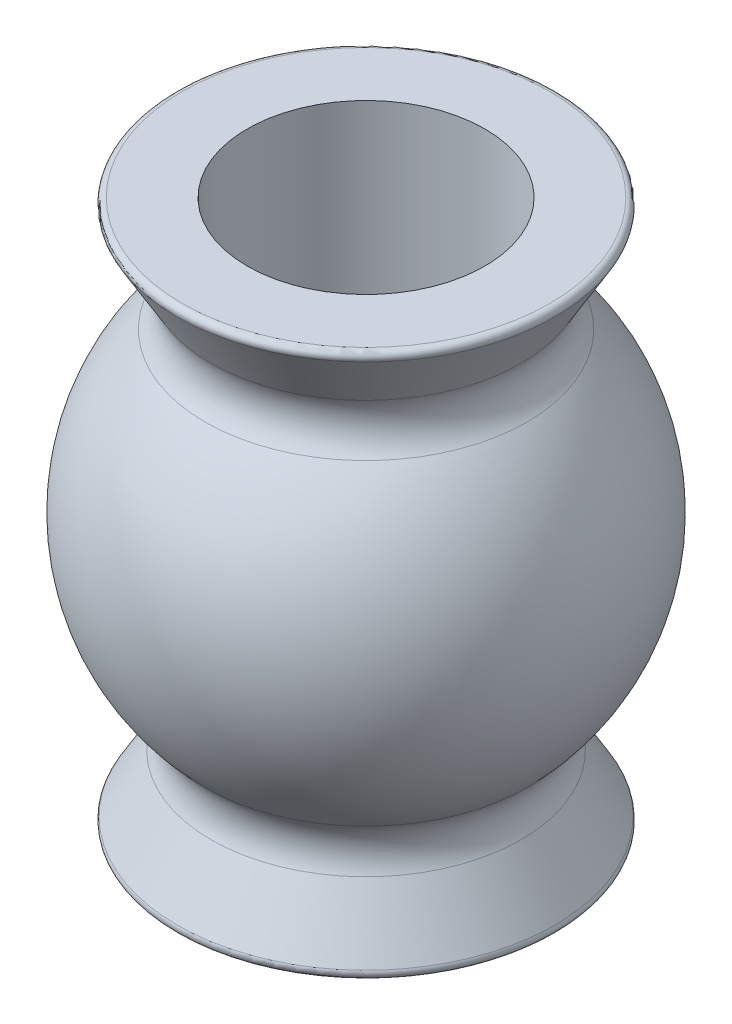
ISO-10303-21;
HEADER;
FILE_DESCRIPTION(('STEP AP214'),'2;1');
FILE_NAME('part.step','',(''),(''),'','','');
FILE_SCHEMA(('AUTOMOTIVE_DESIGN { 1 0 10303 214 1 1 1 1 }'));
ENDSEC;
DATA;
#1=APPLICATION_CONTEXT('core data for automotive mechanical design processes');
#2=APPLICATION_PROTOCOL_DEFINITION('international standard','automotive_design',2000,#1);
#3=PRODUCT_CONTEXT('',#1,'mechanical');
#4=PRODUCT('Part','Part','',(#3));
#5=PRODUCT_RELATED_PRODUCT_CATEGORY('part','',(#4));
#6=PRODUCT_DEFINITION_FORMATION('','',#4);
#7=PRODUCT_DEFINITION_CONTEXT('part definition',#1,'design');
#8=PRODUCT_DEFINITION('design','',#6,#7);
#9=PRODUCT_DEFINITION_SHAPE('','',#8);
#10=(LENGTH_UNIT() NAMED_UNIT(*) SI_UNIT(.MILLI.,.METRE.));
#11=(NAMED_UNIT(*) PLANE_ANGLE_UNIT() SI_UNIT($,.RADIAN.));
#12=(NAMED_UNIT(*) SI_UNIT($,.STERADIAN.) SOLID_ANGLE_UNIT());
#13=UNCERTAINTY_MEASURE_WITH_UNIT(LENGTH_MEASURE(1.E-05),#10,'distance_accuracy_value','');
#14=(GEOMETRIC_REPRESENTATION_CONTEXT(3) GLOBAL_UNCERTAINTY_ASSIGNED_CONTEXT((#13)) GLOBAL_UNIT_ASSIGNED_CONTEXT((#10,
#11,#12)) REPRESENTATION_CONTEXT('',''));
#15=CARTESIAN_POINT('',(0.,0.,0.));
#16=DIRECTION('',(0.,0.,1.));
#17=DIRECTION('',(1.,0.,0.));
#18=AXIS2_PLACEMENT_3D('',#15,#16,#17);
#19=CARTESIAN_POINT('',(2.4892,0.,0.));
#20=DIRECTION('',(0.,-1.,0.));
#21=DIRECTION('',(0.,0.,-1.));
#22=AXIS2_PLACEMENT_3D('',#19,#20,#21);
#23=PLANE('',#22);
#24=CARTESIAN_POINT('',(0.,0.,0.));
#25=DIRECTION('',(0.,-1.,0.));
#26=DIRECTION('',(0.,0.,-1.));
#27=AXIS2_PLACEMENT_3D('',#24,#25,#26);
#28=CIRCLE('',#27,2.35575927111134);
#29=CARTESIAN_POINT('',(0.,0.,-2.35575927111134));
#30=VERTEX_POINT('',#29);
#31=EDGE_CURVE('E45',#30,#30,#28,.T.);
#32=ORIENTED_EDGE('',*,*,#31,.T.);
#33=EDGE_LOOP('',(#32));
#34=FACE_BOUND('',#33,.T.);
#35=CARTESIAN_POINT('',(0.,0.,0.));
#36=DIRECTION('',(0.,-1.,0.));
#37=DIRECTION('',(0.,0.,-1.));
#38=AXIS2_PLACEMENT_3D('',#35,#36,#37);
#39=CIRCLE('',#38,1.524);
#40=CARTESIAN_POINT('',(0.,0.,-1.524));
#41=VERTEX_POINT('',#40);
#42=EDGE_CURVE('E62',#41,#41,#39,.T.);
#43=ORIENTED_EDGE('',*,*,#42,.F.);
#44=EDGE_LOOP('',(#43));
#45=FACE_BOUND('',#44,.T.);
#46=ADVANCED_FACE('F30',(#34,#45),#23,.T.);
#47=CARTESIAN_POINT('',(0.,0.,0.));
#48=DIRECTION('',(0.,-1.,0.));
#49=DIRECTION('',(0.,0.,-1.));
#50=AXIS2_PLACEMENT_3D('',#47,#48,#49);
#51=CYLINDRICAL_SURFACE('',#50,1.524);
#52=ORIENTED_EDGE('',*,*,#42,.T.);
#53=EDGE_LOOP('',(#52));
#54=FACE_BOUND('',#53,.T.);
#55=CARTESIAN_POINT('',(0.,6.985,0.));
#56=DIRECTION('',(0.,-1.,0.));
#57=DIRECTION('',(0.,0.,-1.));
#58=AXIS2_PLACEMENT_3D('',#55,#56,#57);
#59=CIRCLE('',#58,1.524);
#60=CARTESIAN_POINT('',(0.,6.985,-1.524));
#61=VERTEX_POINT('',#60);
#62=EDGE_CURVE('E65',#61,#61,#59,.T.);
#63=ORIENTED_EDGE('',*,*,#62,.F.);
#64=EDGE_LOOP('',(#63));
#65=FACE_BOUND('',#64,.T.);
#66=ADVANCED_FACE('F71',(#54,#65),#51,.F.);
#67=CARTESIAN_POINT('',(1.524,6.985,0.));
#68=DIRECTION('',(0.,1.,0.));
#69=DIRECTION('',(0.,0.,1.));
#70=AXIS2_PLACEMENT_3D('',#67,#68,#69);
#71=PLANE('',#70);
#72=CARTESIAN_POINT('',(0.,6.985,0.));
#73=DIRECTION('',(0.,1.,0.));
#74=DIRECTION('',(0.,0.,1.));
#75=AXIS2_PLACEMENT_3D('',#72,#73,#74);
#76=CIRCLE('',#75,2.35575927111134);
#77=CARTESIAN_POINT('',(0.,6.985,2.35575927111134));
#78=VERTEX_POINT('',#77);
#79=EDGE_CURVE('E10',#78,#78,#76,.T.);
#80=ORIENTED_EDGE('',*,*,#79,.T.);
#81=EDGE_LOOP('',(#80));
#82=FACE_BOUND('',#81,.T.);
#83=ORIENTED_EDGE('',*,*,#62,.T.);
#84=EDGE_LOOP('',(#83));
#85=FACE_BOUND('',#84,.T.);
#86=ADVANCED_FACE('F69',(#82,#85),#71,.T.);
#87=CARTESIAN_POINT('',(0.,5.7785,0.));
#88=DIRECTION('',(0.,1.,0.));
#89=DIRECTION('',(0.,0.,1.));
#90=AXIS2_PLACEMENT_3D('',#87,#88,#89);
#91=CONICAL_SURFACE('',#90,1.77727413754885,0.533089972720094);
#92=CARTESIAN_POINT('',(0.,6.87007539059065,0.));
#93=DIRECTION('',(0.,-1.,0.));
#94=DIRECTION('',(0.,0.,-1.));
#95=AXIS2_PLACEMENT_3D('',#92,#93,#94);
#96=CIRCLE('',#95,2.42138582538698);
#97=CARTESIAN_POINT('',(0.,6.87007539059065,-2.42138582538698));
#98=VERTEX_POINT('',#97);
#99=EDGE_CURVE('E37',#98,#98,#96,.T.);
#100=ORIENTED_EDGE('',*,*,#99,.T.);
#101=EDGE_LOOP('',(#100));
#102=FACE_BOUND('',#101,.T.);
#103=CARTESIAN_POINT('',(0.,6.1373710390865,0.));
#104=DIRECTION('',(0.,1.,0.));
#105=DIRECTION('',(0.,0.,1.));
#106=AXIS2_PLACEMENT_3D('',#103,#104,#105);
#107=CIRCLE('',#106,1.98903507746629);
#108=CARTESIAN_POINT('',(0.,6.1373710390865,1.98903507746629));
#109=VERTEX_POINT('',#108);
#110=EDGE_CURVE('E50',#109,#109,#107,.T.);
#111=ORIENTED_EDGE('',*,*,#110,.T.);
#112=EDGE_LOOP('',(#111));
#113=FACE_BOUND('',#112,.T.);
#114=ADVANCED_FACE('F79',(#102,#113),#91,.T.);
#115=CARTESIAN_POINT('',(0.,3.4925,0.));
#116=DIRECTION('',(0.,-1.,0.));
#117=DIRECTION('',(1.,0.,0.));
#118=AXIS2_PLACEMENT_3D('',#115,#116,#117);
#119=SPHERICAL_SURFACE('',#118,2.8956);
#120=CARTESIAN_POINT('',(0.,1.46201794548691,0.));
#121=DIRECTION('',(0.,1.,0.));
#122=DIRECTION('',(0.,0.,1.));
#123=AXIS2_PLACEMENT_3D('',#120,#121,#122);
#124=CIRCLE('',#123,2.06437447821375);
#125=CARTESIAN_POINT('',(0.,1.46201794548691,2.06437447821375));
#126=VERTEX_POINT('',#125);
#127=EDGE_CURVE('E53',#126,#126,#124,.T.);
#128=ORIENTED_EDGE('',*,*,#127,.T.);
#129=EDGE_LOOP('',(#128));
#130=FACE_BOUND('',#129,.T.);
#131=CARTESIAN_POINT('',(0.,5.52298205451309,0.));
#132=DIRECTION('',(0.,-1.,0.));
#133=DIRECTION('',(0.,0.,-1.));
#134=AXIS2_PLACEMENT_3D('',#131,#132,#133);
#135=CIRCLE('',#134,2.06437447821375);
#136=CARTESIAN_POINT('',(0.,5.52298205451309,-2.06437447821375));
#137=VERTEX_POINT('',#136);
#138=EDGE_CURVE('E56',#137,#137,#135,.T.);
#139=ORIENTED_EDGE('',*,*,#138,.T.);
#140=EDGE_LOOP('',(#139));
#141=FACE_BOUND('',#140,.T.);
#142=ADVANCED_FACE('F108',(#130,#141),#119,.T.);
#143=CARTESIAN_POINT('',(0.,0.,0.));
#144=DIRECTION('',(0.,-1.,0.));
#145=DIRECTION('',(0.,0.,-1.));
#146=AXIS2_PLACEMENT_3D('',#143,#144,#145);
#147=CONICAL_SURFACE('',#146,2.4892,0.533089972720094);
#148=CARTESIAN_POINT('',(0.,0.11492460940935,0.));
#149=DIRECTION('',(0.,1.,0.));
#150=DIRECTION('',(0.,0.,1.));
#151=AXIS2_PLACEMENT_3D('',#148,#149,#150);
#152=CIRCLE('',#151,2.42138582538698);
#153=CARTESIAN_POINT('',(0.,0.11492460940935,2.42138582538698));
#154=VERTEX_POINT('',#153);
#155=EDGE_CURVE('E41',#154,#154,#152,.T.);
#156=ORIENTED_EDGE('',*,*,#155,.T.);
#157=EDGE_LOOP('',(#156));
#158=FACE_BOUND('',#157,.T.);
#159=CARTESIAN_POINT('',(0.,0.847628960913503,0.));
#160=DIRECTION('',(0.,-1.,0.));
#161=DIRECTION('',(0.,0.,-1.));
#162=AXIS2_PLACEMENT_3D('',#159,#160,#161);
#163=CIRCLE('',#162,1.98903507746629);
#164=CARTESIAN_POINT('',(0.,0.847628960913503,-1.98903507746629));
#165=VERTEX_POINT('',#164);
#166=EDGE_CURVE('E59',#165,#165,#163,.T.);
#167=ORIENTED_EDGE('',*,*,#166,.T.);
#168=EDGE_LOOP('',(#167));
#169=FACE_BOUND('',#168,.T.);
#170=ADVANCED_FACE('F89',(#158,#169),#147,.T.);
#171=CARTESIAN_POINT('',(0.,1.1057930236425,0.));
#172=DIRECTION('',(0.,1.,0.));
#173=DIRECTION('',(0.,0.,1.));
#174=AXIS2_PLACEMENT_3D('',#171,#172,#173);
#175=TOROIDAL_SURFACE('',#174,2.42654543930388,0.508);
#176=ORIENTED_EDGE('',*,*,#127,.F.);
#177=EDGE_LOOP('',(#176));
#178=FACE_BOUND('',#177,.T.);
#179=ORIENTED_EDGE('',*,*,#166,.F.);
#180=EDGE_LOOP('',(#179));
#181=FACE_BOUND('',#180,.T.);
#182=ADVANCED_FACE('F85',(#178,#181),#175,.F.);
#183=CARTESIAN_POINT('',(0.,5.8792069763575,0.));
#184=DIRECTION('',(0.,-1.,0.));
#185=DIRECTION('',(0.,0.,-1.));
#186=AXIS2_PLACEMENT_3D('',#183,#184,#185);
#187=TOROIDAL_SURFACE('',#186,2.42654543930388,0.508);
#188=ORIENTED_EDGE('',*,*,#110,.F.);
#189=EDGE_LOOP('',(#188));
#190=FACE_BOUND('',#189,.T.);
#191=ORIENTED_EDGE('',*,*,#138,.F.);
#192=EDGE_LOOP('',(#191));
#193=FACE_BOUND('',#192,.T.);
#194=ADVANCED_FACE('F88',(#190,#193),#187,.F.);
#195=CARTESIAN_POINT('',(0.,0.0761999999999999,0.));
#196=DIRECTION('',(0.,-1.,0.));
#197=DIRECTION('',(0.,0.,-1.));
#198=AXIS2_PLACEMENT_3D('',#195,#196,#197);
#199=TOROIDAL_SURFACE('',#198,2.35575927111134,0.0762);
#200=ORIENTED_EDGE('',*,*,#155,.F.);
#201=EDGE_LOOP('',(#200));
#202=FACE_BOUND('',#201,.T.);
#203=ORIENTED_EDGE('',*,*,#31,.F.);
#204=EDGE_LOOP('',(#203));
#205=FACE_BOUND('',#204,.T.);
#206=ADVANCED_FACE('F92',(#202,#205),#199,.T.);
#207=CARTESIAN_POINT('',(0.,6.9088,0.));
#208=DIRECTION('',(0.,1.,0.));
#209=DIRECTION('',(0.,0.,1.));
#210=AXIS2_PLACEMENT_3D('',#207,#208,#209);
#211=TOROIDAL_SURFACE('',#210,2.35575927111134,0.0762);
#212=ORIENTED_EDGE('',*,*,#79,.F.);
#213=EDGE_LOOP('',(#212));
#214=FACE_BOUND('',#213,.T.);
#215=ORIENTED_EDGE('',*,*,#99,.F.);
#216=EDGE_LOOP('',(#215));
#217=FACE_BOUND('',#216,.T.);
#218=ADVANCED_FACE('F32',(#214,#217),#211,.T.);
#219=CLOSED_SHELL('',(#46,#66,#86,#114,#142,#170,#182,#194,#206,#218));
#220=MANIFOLD_SOLID_BREP('B2',#219);
#221=ADVANCED_BREP_SHAPE_REPRESENTATION('',(#18,#220),#14);
#222=SHAPE_DEFINITION_REPRESENTATION(#9,#221);
ENDSEC;
END-ISO-10303-21;
